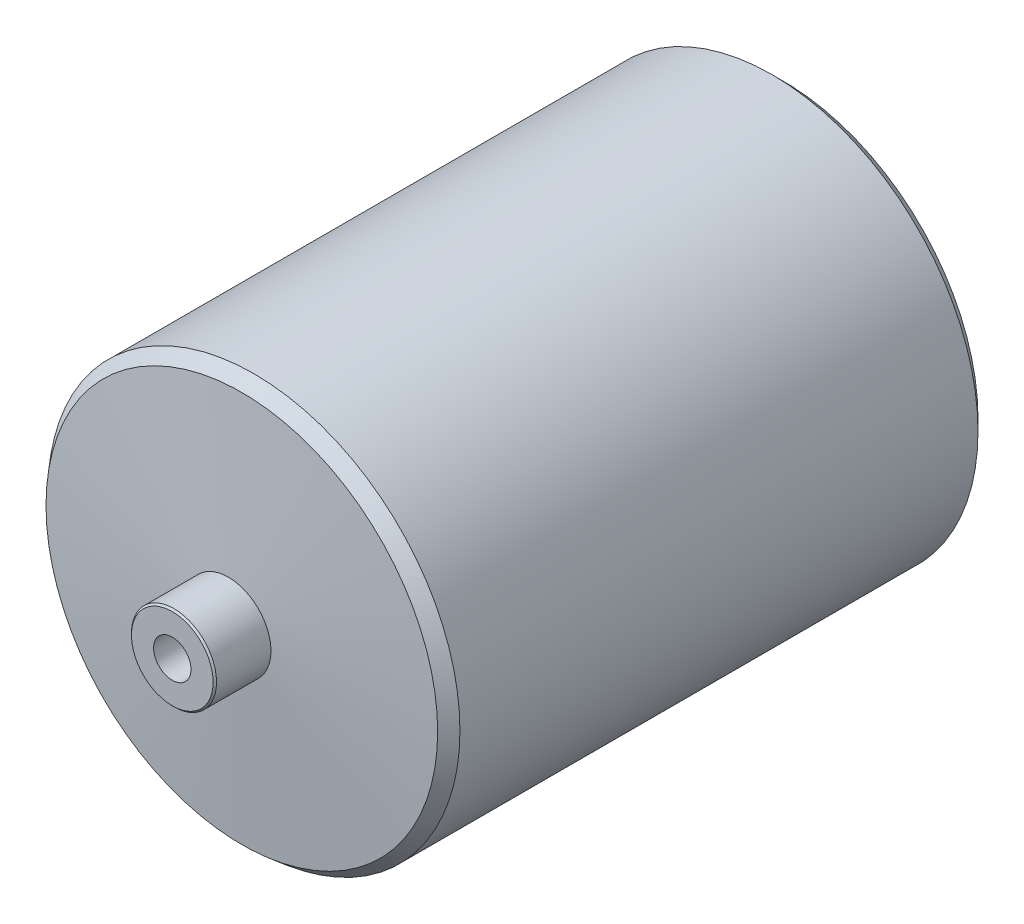
ISO-10303-21;
HEADER;
FILE_DESCRIPTION(('STEP AP214'),'2;1');
FILE_NAME('part.step','',(''),(''),'','','');
FILE_SCHEMA(('AUTOMOTIVE_DESIGN { 1 0 10303 214 1 1 1 1 }'));
ENDSEC;
DATA;
#1=APPLICATION_CONTEXT('core data for automotive mechanical design processes');
#2=APPLICATION_PROTOCOL_DEFINITION('international standard','automotive_design',2000,#1);
#3=PRODUCT_CONTEXT('',#1,'mechanical');
#4=PRODUCT('Part','Part','',(#3));
#5=PRODUCT_RELATED_PRODUCT_CATEGORY('part','',(#4));
#6=PRODUCT_DEFINITION_FORMATION('','',#4);
#7=PRODUCT_DEFINITION_CONTEXT('part definition',#1,'design');
#8=PRODUCT_DEFINITION('design','',#6,#7);
#9=PRODUCT_DEFINITION_SHAPE('','',#8);
#10=(LENGTH_UNIT() NAMED_UNIT(*) SI_UNIT(.MILLI.,.METRE.));
#11=(NAMED_UNIT(*) PLANE_ANGLE_UNIT() SI_UNIT($,.RADIAN.));
#12=(NAMED_UNIT(*) SI_UNIT($,.STERADIAN.) SOLID_ANGLE_UNIT());
#13=UNCERTAINTY_MEASURE_WITH_UNIT(LENGTH_MEASURE(1.E-05),#10,'distance_accuracy_value','');
#14=(GEOMETRIC_REPRESENTATION_CONTEXT(3) GLOBAL_UNCERTAINTY_ASSIGNED_CONTEXT((#13)) GLOBAL_UNIT_ASSIGNED_CONTEXT((#10,
#11,#12)) REPRESENTATION_CONTEXT('',''));
#15=CARTESIAN_POINT('',(0.,0.,0.));
#16=DIRECTION('',(0.,0.,1.));
#17=DIRECTION('',(1.,0.,0.));
#18=AXIS2_PLACEMENT_3D('',#15,#16,#17);
#19=CARTESIAN_POINT('',(0.,0.,0.));
#20=DIRECTION('',(0.,0.,1.));
#21=DIRECTION('',(1.,0.,0.));
#22=AXIS2_PLACEMENT_3D('',#19,#20,#21);
#23=PLANE('',#22);
#24=CARTESIAN_POINT('',(0.,0.,0.));
#25=DIRECTION('',(0.,0.,1.));
#26=DIRECTION('',(1.,0.,0.));
#27=AXIS2_PLACEMENT_3D('',#24,#25,#26);
#28=CIRCLE('',#27,5.49999999999999);
#29=CARTESIAN_POINT('',(5.49999999999999,0.,0.));
#30=VERTEX_POINT('',#29);
#31=EDGE_CURVE('E73',#30,#30,#28,.T.);
#32=ORIENTED_EDGE('',*,*,#31,.F.);
#33=EDGE_LOOP('',(#32));
#34=FACE_BOUND('',#33,.T.);
#35=CARTESIAN_POINT('',(0.,0.,0.));
#36=DIRECTION('',(0.,0.,1.));
#37=DIRECTION('',(1.,0.,0.));
#38=AXIS2_PLACEMENT_3D('',#35,#36,#37);
#39=CIRCLE('',#38,12.);
#40=CARTESIAN_POINT('',(12.,0.,0.));
#41=VERTEX_POINT('',#40);
#42=EDGE_CURVE('E11',#41,#41,#39,.T.);
#43=ORIENTED_EDGE('',*,*,#42,.T.);
#44=EDGE_LOOP('',(#43));
#45=FACE_BOUND('',#44,.T.);
#46=ADVANCED_FACE('F45',(#34,#45),#23,.T.);
#47=CARTESIAN_POINT('',(0.,0.,-200.));
#48=DIRECTION('',(0.,0.,-1.));
#49=DIRECTION('',(-1.,0.,0.));
#50=AXIS2_PLACEMENT_3D('',#47,#48,#49);
#51=CYLINDRICAL_SURFACE('',#50,12.5);
#52=CARTESIAN_POINT('',(0.,0.,-0.499999999999973));
#53=DIRECTION('',(0.,0.,1.));
#54=DIRECTION('',(1.,0.,0.));
#55=AXIS2_PLACEMENT_3D('',#52,#53,#54);
#56=CIRCLE('',#55,12.5);
#57=CARTESIAN_POINT('',(12.5,0.,-0.499999999999973));
#58=VERTEX_POINT('',#57);
#59=EDGE_CURVE('E55',#58,#58,#56,.F.);
#60=ORIENTED_EDGE('',*,*,#59,.T.);
#61=EDGE_LOOP('',(#60));
#62=FACE_BOUND('',#61,.T.);
#63=CARTESIAN_POINT('',(0.,0.,-16.5));
#64=DIRECTION('',(0.,0.,-1.));
#65=DIRECTION('',(-1.,0.,0.));
#66=AXIS2_PLACEMENT_3D('',#63,#64,#65);
#67=CIRCLE('',#66,12.5);
#68=CARTESIAN_POINT('',(-12.5,0.,-16.5));
#69=VERTEX_POINT('',#68);
#70=EDGE_CURVE('E90',#69,#69,#67,.T.);
#71=ORIENTED_EDGE('',*,*,#70,.F.);
#72=EDGE_LOOP('',(#71));
#73=FACE_BOUND('',#72,.T.);
#74=ADVANCED_FACE('F121',(#62,#73),#51,.T.);
#75=CARTESIAN_POINT('',(0.,0.,-20.7043760092551));
#76=DIRECTION('',(0.,0.,-1.));
#77=DIRECTION('',(-1.,0.,0.));
#78=AXIS2_PLACEMENT_3D('',#75,#76,#77);
#79=CONICAL_SURFACE('',#78,60.5562376862593,1.48352986419518);
#80=CARTESIAN_POINT('',(0.,0.,-20.4429087810122));
#81=DIRECTION('',(0.,0.,1.));
#82=DIRECTION('',(1.,0.,0.));
#83=AXIS2_PLACEMENT_3D('',#80,#81,#82);
#84=CIRCLE('',#83,57.567653591984);
#85=CARTESIAN_POINT('',(57.567653591984,0.,-20.4429087810122));
#86=VERTEX_POINT('',#85);
#87=EDGE_CURVE('E106',#86,#86,#84,.T.);
#88=ORIENTED_EDGE('',*,*,#87,.T.);
#89=EDGE_LOOP('',(#88));
#90=FACE_BOUND('',#89,.T.);
#91=ORIENTED_EDGE('',*,*,#70,.T.);
#92=EDGE_LOOP('',(#91));
#93=FACE_BOUND('',#92,.T.);
#94=ADVANCED_FACE('F142',(#90,#93),#79,.T.);
#95=CARTESIAN_POINT('',(0.,0.,-200.));
#96=DIRECTION('',(0.,0.,-1.));
#97=DIRECTION('',(-1.,0.,0.));
#98=AXIS2_PLACEMENT_3D('',#95,#96,#97);
#99=CYLINDRICAL_SURFACE('',#98,60.5562376862593);
#100=CARTESIAN_POINT('',(0.,0.,-176.295623990745));
#101=DIRECTION('',(0.,0.,-1.));
#102=DIRECTION('',(-1.,0.,0.));
#103=AXIS2_PLACEMENT_3D('',#100,#101,#102);
#104=CIRCLE('',#103,60.5562376862593);
#105=CARTESIAN_POINT('',(-60.5562376862593,0.,-176.295623990745));
#106=VERTEX_POINT('',#105);
#107=EDGE_CURVE('E102',#106,#106,#104,.F.);
#108=ORIENTED_EDGE('',*,*,#107,.T.);
#109=EDGE_LOOP('',(#108));
#110=FACE_BOUND('',#109,.T.);
#111=CARTESIAN_POINT('',(0.,0.,-24.0045646121346));
#112=DIRECTION('',(0.,0.,1.));
#113=DIRECTION('',(1.,0.,0.));
#114=AXIS2_PLACEMENT_3D('',#111,#112,#113);
#115=CIRCLE('',#114,60.5562376862593);
#116=CARTESIAN_POINT('',(60.5562376862593,0.,-24.0045646121346));
#117=VERTEX_POINT('',#116);
#118=EDGE_CURVE('E98',#117,#117,#115,.F.);
#119=ORIENTED_EDGE('',*,*,#118,.T.);
#120=EDGE_LOOP('',(#119));
#121=FACE_BOUND('',#120,.T.);
#122=ADVANCED_FACE('F172',(#110,#121),#99,.T.);
#123=CARTESIAN_POINT('',(0.,0.,-183.5));
#124=DIRECTION('',(0.,0.,1.));
#125=DIRECTION('',(1.,0.,0.));
#126=AXIS2_PLACEMENT_3D('',#123,#124,#125);
#127=CONICAL_SURFACE('',#126,12.5,1.48352986419518);
#128=CARTESIAN_POINT('',(0.,0.,-179.583254379637));
#129=DIRECTION('',(0.,0.,-1.));
#130=DIRECTION('',(-1.,0.,0.));
#131=AXIS2_PLACEMENT_3D('',#128,#129,#130);
#132=CIRCLE('',#131,57.268607297368);
#133=CARTESIAN_POINT('',(-57.268607297368,0.,-179.583254379637));
#134=VERTEX_POINT('',#133);
#135=EDGE_CURVE('E94',#134,#134,#132,.T.);
#136=ORIENTED_EDGE('',*,*,#135,.T.);
#137=EDGE_LOOP('',(#136));
#138=FACE_BOUND('',#137,.T.);
#139=CARTESIAN_POINT('',(0.,0.,-183.5));
#140=DIRECTION('',(0.,0.,-1.));
#141=DIRECTION('',(-1.,0.,0.));
#142=AXIS2_PLACEMENT_3D('',#139,#140,#141);
#143=CIRCLE('',#142,12.5);
#144=CARTESIAN_POINT('',(-12.5,0.,-183.5));
#145=VERTEX_POINT('',#144);
#146=EDGE_CURVE('E86',#145,#145,#143,.T.);
#147=ORIENTED_EDGE('',*,*,#146,.F.);
#148=EDGE_LOOP('',(#147));
#149=FACE_BOUND('',#148,.T.);
#150=ADVANCED_FACE('F174',(#138,#149),#127,.T.);
#151=CARTESIAN_POINT('',(0.,0.,-200.));
#152=DIRECTION('',(0.,0.,-1.));
#153=DIRECTION('',(-1.,0.,0.));
#154=AXIS2_PLACEMENT_3D('',#151,#152,#153);
#155=CYLINDRICAL_SURFACE('',#154,12.5);
#156=CARTESIAN_POINT('',(0.,0.,-199.5));
#157=DIRECTION('',(0.,0.,-1.));
#158=DIRECTION('',(-1.,0.,0.));
#159=AXIS2_PLACEMENT_3D('',#156,#157,#158);
#160=CIRCLE('',#159,12.5);
#161=CARTESIAN_POINT('',(-12.5,0.,-199.5));
#162=VERTEX_POINT('',#161);
#163=EDGE_CURVE('E114',#162,#162,#160,.F.);
#164=ORIENTED_EDGE('',*,*,#163,.T.);
#165=EDGE_LOOP('',(#164));
#166=FACE_BOUND('',#165,.T.);
#167=ORIENTED_EDGE('',*,*,#146,.T.);
#168=EDGE_LOOP('',(#167));
#169=FACE_BOUND('',#168,.T.);
#170=ADVANCED_FACE('F181',(#166,#169),#155,.T.);
#171=CARTESIAN_POINT('',(0.,12.5,-200.));
#172=DIRECTION('',(0.,0.,-1.));
#173=DIRECTION('',(-1.,0.,0.));
#174=AXIS2_PLACEMENT_3D('',#171,#172,#173);
#175=PLANE('',#174);
#176=CARTESIAN_POINT('',(0.,0.,-200.));
#177=DIRECTION('',(0.,0.,-1.));
#178=DIRECTION('',(-1.,0.,0.));
#179=AXIS2_PLACEMENT_3D('',#176,#177,#178);
#180=CIRCLE('',#179,5.49999999999999);
#181=CARTESIAN_POINT('',(-5.49999999999999,0.,-200.));
#182=VERTEX_POINT('',#181);
#183=EDGE_CURVE('E72',#182,#182,#180,.T.);
#184=ORIENTED_EDGE('',*,*,#183,.F.);
#185=EDGE_LOOP('',(#184));
#186=FACE_BOUND('',#185,.T.);
#187=CARTESIAN_POINT('',(0.,0.,-200.));
#188=DIRECTION('',(0.,0.,-1.));
#189=DIRECTION('',(-1.,0.,0.));
#190=AXIS2_PLACEMENT_3D('',#187,#188,#189);
#191=CIRCLE('',#190,12.);
#192=CARTESIAN_POINT('',(-12.,0.,-200.));
#193=VERTEX_POINT('',#192);
#194=EDGE_CURVE('E110',#193,#193,#191,.T.);
#195=ORIENTED_EDGE('',*,*,#194,.T.);
#196=EDGE_LOOP('',(#195));
#197=FACE_BOUND('',#196,.T.);
#198=ADVANCED_FACE('F155',(#186,#197),#175,.T.);
#199=CARTESIAN_POINT('',(0.,0.,-179.583254379637));
#200=DIRECTION('',(0.,0.,1.));
#201=DIRECTION('',(1.,0.,0.));
#202=AXIS2_PLACEMENT_3D('',#199,#200,#201);
#203=CONICAL_SURFACE('',#202,57.268607297368,0.785398163397442);
#204=ORIENTED_EDGE('',*,*,#107,.F.);
#205=EDGE_LOOP('',(#204));
#206=FACE_BOUND('',#205,.T.);
#207=ORIENTED_EDGE('',*,*,#135,.F.);
#208=EDGE_LOOP('',(#207));
#209=FACE_BOUND('',#208,.T.);
#210=ADVANCED_FACE('F149',(#206,#209),#203,.T.);
#211=CARTESIAN_POINT('',(0.,0.,-24.0045646121346));
#212=DIRECTION('',(0.,0.,-1.));
#213=DIRECTION('',(-1.,0.,0.));
#214=AXIS2_PLACEMENT_3D('',#211,#212,#213);
#215=CONICAL_SURFACE('',#214,60.5562376862593,0.698131700797733);
#216=ORIENTED_EDGE('',*,*,#87,.F.);
#217=EDGE_LOOP('',(#216));
#218=FACE_BOUND('',#217,.T.);
#219=ORIENTED_EDGE('',*,*,#118,.F.);
#220=EDGE_LOOP('',(#219));
#221=FACE_BOUND('',#220,.T.);
#222=ADVANCED_FACE('F133',(#218,#221),#215,.T.);
#223=CARTESIAN_POINT('',(0.,0.,-200.));
#224=DIRECTION('',(0.,0.,1.));
#225=DIRECTION('',(1.,0.,0.));
#226=AXIS2_PLACEMENT_3D('',#223,#224,#225);
#227=CONICAL_SURFACE('',#226,12.,0.78539816339741);
#228=ORIENTED_EDGE('',*,*,#163,.F.);
#229=EDGE_LOOP('',(#228));
#230=FACE_BOUND('',#229,.T.);
#231=ORIENTED_EDGE('',*,*,#194,.F.);
#232=EDGE_LOOP('',(#231));
#233=FACE_BOUND('',#232,.T.);
#234=ADVANCED_FACE('F126',(#230,#233),#227,.T.);
#235=CARTESIAN_POINT('',(0.,0.,-0.499999999999973));
#236=DIRECTION('',(0.,0.,-1.));
#237=DIRECTION('',(-1.,0.,0.));
#238=AXIS2_PLACEMENT_3D('',#235,#236,#237);
#239=CONICAL_SURFACE('',#238,12.5,0.785398163397466);
#240=ORIENTED_EDGE('',*,*,#42,.F.);
#241=EDGE_LOOP('',(#240));
#242=FACE_BOUND('',#241,.T.);
#243=ORIENTED_EDGE('',*,*,#59,.F.);
#244=EDGE_LOOP('',(#243));
#245=FACE_BOUND('',#244,.T.);
#246=ADVANCED_FACE('F48',(#242,#245),#239,.T.);
#247=CARTESIAN_POINT('',(0.,0.,-144.304733404652));
#248=DIRECTION('',(0.,0.,-1.));
#249=DIRECTION('',(-1.,0.,0.));
#250=AXIS2_PLACEMENT_3D('',#247,#248,#249);
#251=CONICAL_SURFACE('',#250,5.49999999999999,1.02974425867665);
#252=CARTESIAN_POINT('',(0.,0.,-141.));
#253=VERTEX_POINT('',#252);
#254=VERTEX_LOOP('',#253);
#255=FACE_BOUND('',#254,.T.);
#256=CARTESIAN_POINT('',(0.,0.,-144.304733404652));
#257=DIRECTION('',(0.,0.,-1.));
#258=DIRECTION('',(-1.,0.,0.));
#259=AXIS2_PLACEMENT_3D('',#256,#257,#258);
#260=CIRCLE('',#259,5.49999999999999);
#261=CARTESIAN_POINT('',(-5.49999999999999,0.,-144.304733404652));
#262=VERTEX_POINT('',#261);
#263=EDGE_CURVE('E78',#262,#262,#260,.T.);
#264=ORIENTED_EDGE('',*,*,#263,.T.);
#265=EDGE_LOOP('',(#264));
#266=FACE_BOUND('',#265,.T.);
#267=ADVANCED_FACE('F125',(#255,#266),#251,.F.);
#268=CARTESIAN_POINT('',(0.,0.,-200.));
#269=DIRECTION('',(0.,0.,-1.));
#270=DIRECTION('',(-1.,0.,0.));
#271=AXIS2_PLACEMENT_3D('',#268,#269,#270);
#272=CYLINDRICAL_SURFACE('',#271,5.49999999999999);
#273=ORIENTED_EDGE('',*,*,#263,.F.);
#274=EDGE_LOOP('',(#273));
#275=FACE_BOUND('',#274,.T.);
#276=ORIENTED_EDGE('',*,*,#183,.T.);
#277=EDGE_LOOP('',(#276));
#278=FACE_BOUND('',#277,.T.);
#279=ADVANCED_FACE('F65',(#275,#278),#272,.F.);
#280=CARTESIAN_POINT('',(0.,0.,-55.6952665953484));
#281=DIRECTION('',(0.,0.,1.));
#282=DIRECTION('',(1.,0.,0.));
#283=AXIS2_PLACEMENT_3D('',#280,#281,#282);
#284=CONICAL_SURFACE('',#283,5.49999999999999,1.02974425867665);
#285=CARTESIAN_POINT('',(0.,0.,-59.));
#286=VERTEX_POINT('',#285);
#287=VERTEX_LOOP('',#286);
#288=FACE_BOUND('',#287,.T.);
#289=CARTESIAN_POINT('',(0.,0.,-55.6952665953484));
#290=DIRECTION('',(0.,0.,1.));
#291=DIRECTION('',(1.,0.,0.));
#292=AXIS2_PLACEMENT_3D('',#289,#290,#291);
#293=CIRCLE('',#292,5.49999999999999);
#294=CARTESIAN_POINT('',(5.49999999999999,0.,-55.6952665953484));
#295=VERTEX_POINT('',#294);
#296=EDGE_CURVE('E69',#295,#295,#293,.T.);
#297=ORIENTED_EDGE('',*,*,#296,.T.);
#298=EDGE_LOOP('',(#297));
#299=FACE_BOUND('',#298,.T.);
#300=ADVANCED_FACE('F61',(#288,#299),#284,.F.);
#301=CARTESIAN_POINT('',(0.,0.,0.));
#302=DIRECTION('',(0.,0.,1.));
#303=DIRECTION('',(1.,0.,0.));
#304=AXIS2_PLACEMENT_3D('',#301,#302,#303);
#305=CYLINDRICAL_SURFACE('',#304,5.49999999999999);
#306=ORIENTED_EDGE('',*,*,#296,.F.);
#307=EDGE_LOOP('',(#306));
#308=FACE_BOUND('',#307,.T.);
#309=ORIENTED_EDGE('',*,*,#31,.T.);
#310=EDGE_LOOP('',(#309));
#311=FACE_BOUND('',#310,.T.);
#312=ADVANCED_FACE('F64',(#308,#311),#305,.F.);
#313=CLOSED_SHELL('',(#46,#74,#94,#122,#150,#170,#198,#210,#222,#234,#246,#267,#279,#300,#312));
#314=MANIFOLD_SOLID_BREP('B2',#313);
#315=ADVANCED_BREP_SHAPE_REPRESENTATION('',(#18,#314),#14);
#316=SHAPE_DEFINITION_REPRESENTATION(#9,#315);
ENDSEC;
END-ISO-10303-21;
